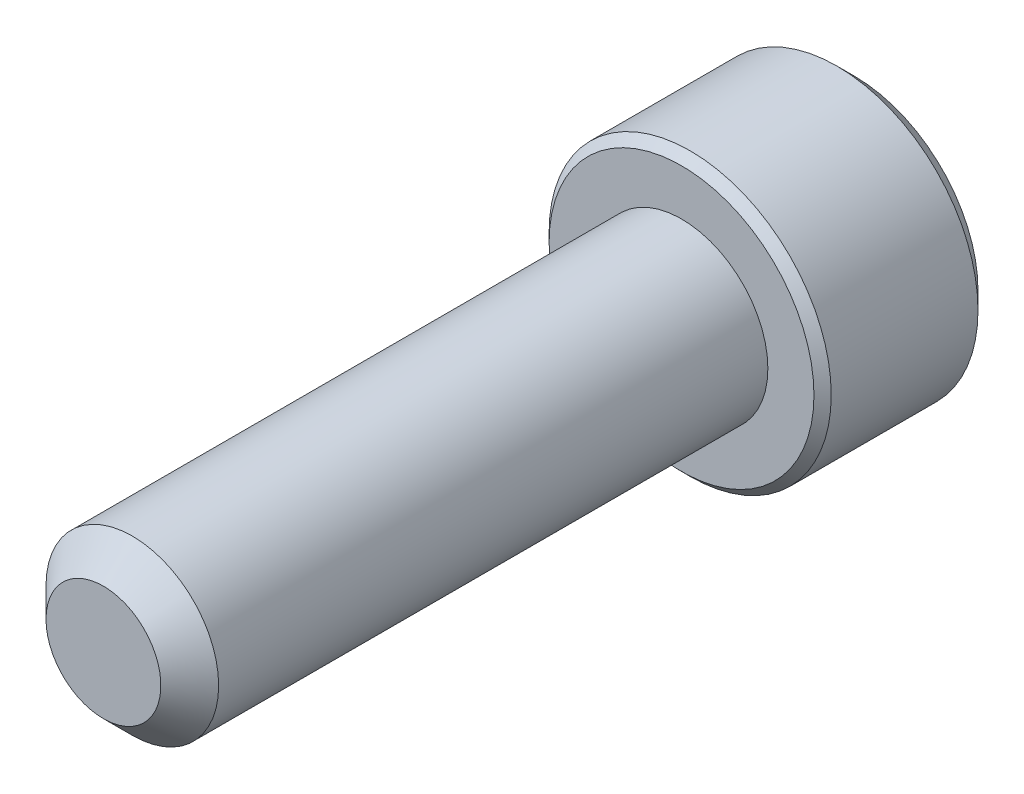
ISO-10303-21;
HEADER;
FILE_DESCRIPTION(('STEP AP214'),'2;1');
FILE_NAME('part.step','',(''),(''),'','','');
FILE_SCHEMA(('AUTOMOTIVE_DESIGN { 1 0 10303 214 1 1 1 1 }'));
ENDSEC;
DATA;
#1=APPLICATION_CONTEXT('core data for automotive mechanical design processes');
#2=APPLICATION_PROTOCOL_DEFINITION('international standard','automotive_design',2000,#1);
#3=PRODUCT_CONTEXT('',#1,'mechanical');
#4=PRODUCT('Part','Part','',(#3));
#5=PRODUCT_RELATED_PRODUCT_CATEGORY('part','',(#4));
#6=PRODUCT_DEFINITION_FORMATION('','',#4);
#7=PRODUCT_DEFINITION_CONTEXT('part definition',#1,'design');
#8=PRODUCT_DEFINITION('design','',#6,#7);
#9=PRODUCT_DEFINITION_SHAPE('','',#8);
#10=(LENGTH_UNIT() NAMED_UNIT(*) SI_UNIT(.MILLI.,.METRE.));
#11=(NAMED_UNIT(*) PLANE_ANGLE_UNIT() SI_UNIT($,.RADIAN.));
#12=(NAMED_UNIT(*) SI_UNIT($,.STERADIAN.) SOLID_ANGLE_UNIT());
#13=UNCERTAINTY_MEASURE_WITH_UNIT(LENGTH_MEASURE(1.E-05),#10,'distance_accuracy_value','');
#14=(GEOMETRIC_REPRESENTATION_CONTEXT(3) GLOBAL_UNCERTAINTY_ASSIGNED_CONTEXT((#13)) GLOBAL_UNIT_ASSIGNED_CONTEXT((#10,
#11,#12)) REPRESENTATION_CONTEXT('',''));
#15=CARTESIAN_POINT('',(0.,0.,0.));
#16=DIRECTION('',(0.,0.,1.));
#17=DIRECTION('',(1.,0.,0.));
#18=AXIS2_PLACEMENT_3D('',#15,#16,#17);
#19=CARTESIAN_POINT('',(0.,-1.3748153285078,-10.5838625));
#20=DIRECTION('',(-0.5,-0.866025403784439,0.));
#21=DIRECTION('',(0.866025403784439,-0.5,0.));
#22=AXIS2_PLACEMENT_3D('',#19,#20,#21);
#23=PLANE('',#22);
#24=CARTESIAN_POINT('',(-1.19062499999881,-0.687407664254587,-12.369799999977));
#25=CARTESIAN_POINT('',(-1.14970263914881,-0.71103420030721,-12.3461961353085));
#26=CARTESIAN_POINT('',(-1.10809605274547,-0.735055774167238,-12.3239787963404));
#27=CARTESIAN_POINT('',(-1.02325595332752,-0.784038228404265,-12.283299797289));
#28=CARTESIAN_POINT('',(-0.980014376423833,-0.809003764469793,-12.2648607635923));
#29=CARTESIAN_POINT('',(-0.892819863316976,-0.859345540083896,-12.233274570625));
#30=CARTESIAN_POINT('',(-0.848889120869722,-0.884708966061518,-12.2200480421541));
#31=CARTESIAN_POINT('',(-0.760060747044089,-0.935994051601424,-12.1996700714323));
#32=CARTESIAN_POINT('',(-0.715165827349434,-0.96191414557238,-12.1925034234483));
#33=CARTESIAN_POINT('',(-0.637785345129712,-1.00658978781196,-12.1860368684439));
#34=CARTESIAN_POINT('',(-0.605399644530298,-1.02528768077093,-12.1850799496617));
#35=CARTESIAN_POINT('',(-0.540685248328487,-1.06265055483848,-12.1866947291663));
#36=CARTESIAN_POINT('',(-0.508356566897669,-1.08131552776511,-12.1892672069147));
#37=CARTESIAN_POINT('',(-0.444011322798376,-1.11846527176691,-12.1977920715166));
#38=CARTESIAN_POINT('',(-0.411995078564867,-1.13694985899357,-12.2037476013051));
#39=CARTESIAN_POINT('',(-0.348497138371782,-1.17361041185703,-12.2187178210994));
#40=CARTESIAN_POINT('',(-0.317015677881833,-1.19178624154539,-12.2277338237807));
#41=CARTESIAN_POINT('',(-0.236423425363977,-1.23831620023117,-12.254479235798));
#42=CARTESIAN_POINT('',(-0.187819783521471,-1.26637752593254,-12.274216001141));
#43=CARTESIAN_POINT('',(-0.0925140443550534,-1.32140232009559,-12.3186731392608));
#44=CARTESIAN_POINT('',(-0.0458063370178413,-1.34836902749996,-12.3433772891907));
#45=CARTESIAN_POINT('',(-1.19285972376366E-12,-1.37481532850711,-12.369799999977));
#46=B_SPLINE_CURVE_WITH_KNOTS('',3,(#24,#25,#26,#27,#28,#29,#30,#31,#32,#33,#34,#35,#36,#37,#38,
#39,#40,#41,#42,#43,#44,#45),.UNSPECIFIED.,.F.,.F.,(4,2,2,2,2,2,2,2,2,2,4),(0.,
0.158570945772296,0.318065397807621,0.475027617237847,0.631594801032415,0.743660160720115,
0.855750273845473,0.967944692031846,1.08018729275019,1.25836291038388,1.43596581384777),.UNSPECIFIED.);
#47=CARTESIAN_POINT('',(-1.19062499995943,-0.687407664276631,-12.3697999999539));
#48=VERTEX_POINT('',#47);
#49=CARTESIAN_POINT('',(3.99696768345484E-11,-1.37481532848403,-12.3697999999539));
#50=VERTEX_POINT('',#49);
#51=EDGE_CURVE('E21',#48,#50,#46,.T.);
#52=ORIENTED_EDGE('',*,*,#51,.F.);
#53=DIRECTION('',(0.,0.,1.));
#54=VECTOR('',#53,1.);
#55=CARTESIAN_POINT('',(-1.190625,-0.687407664253898,-10.5838625));
#56=LINE('',#55,#54);
#57=CARTESIAN_POINT('',(-1.190625,-0.687407664253899,-10.5838625));
#58=VERTEX_POINT('',#57);
#59=EDGE_CURVE('E102',#48,#58,#56,.T.);
#60=ORIENTED_EDGE('',*,*,#59,.T.);
#61=DIRECTION('',(0.866025403784439,-0.5,0.));
#62=VECTOR('',#61,1.);
#63=CARTESIAN_POINT('',(0.,-1.3748153285078,-10.5838625));
#64=LINE('',#63,#62);
#65=CARTESIAN_POINT('',(0.,-1.3748153285078,-10.5838625));
#66=VERTEX_POINT('',#65);
#67=EDGE_CURVE('E75',#66,#58,#64,.F.);
#68=ORIENTED_EDGE('',*,*,#67,.F.);
#69=DIRECTION('',(0.,0.,1.));
#70=VECTOR('',#69,1.);
#71=CARTESIAN_POINT('',(0.,-1.3748153285078,-10.5838625));
#72=LINE('',#71,#70);
#73=EDGE_CURVE('E74',#66,#50,#72,.F.);
#74=ORIENTED_EDGE('',*,*,#73,.T.);
#75=EDGE_LOOP('',(#52,#60,#68,#74));
#76=FACE_BOUND('',#75,.T.);
#77=ADVANCED_FACE('F17',(#76),#23,.F.);
#78=CARTESIAN_POINT('',(1.190625,-0.687407664253898,-10.5838625));
#79=DIRECTION('',(0.5,-0.866025403784439,0.));
#80=DIRECTION('',(0.866025403784439,0.5,0.));
#81=AXIS2_PLACEMENT_3D('',#78,#79,#80);
#82=PLANE('',#81);
#83=CARTESIAN_POINT('',(1.1932416085199E-12,-1.37481532850711,-12.369799999977));
#84=CARTESIAN_POINT('',(0.0409223608511937,-1.35118879245448,-12.3461961353085));
#85=CARTESIAN_POINT('',(0.0825289472545307,-1.32716721859446,-12.3239787963404));
#86=CARTESIAN_POINT('',(0.167369046672479,-1.27818476435743,-12.283299797289));
#87=CARTESIAN_POINT('',(0.210610623576167,-1.2532192282919,-12.2648607635923));
#88=CARTESIAN_POINT('',(0.297805136683024,-1.2028774526778,-12.233274570625));
#89=CARTESIAN_POINT('',(0.341735879130278,-1.17751402670018,-12.2200480421541));
#90=CARTESIAN_POINT('',(0.430564252955911,-1.12622894116027,-12.1996700714323));
#91=CARTESIAN_POINT('',(0.475459172650566,-1.10030884718932,-12.1925034234483));
#92=CARTESIAN_POINT('',(0.552839654870287,-1.05563320494974,-12.1860368684439));
#93=CARTESIAN_POINT('',(0.585225355469702,-1.03693531199077,-12.1850799496617));
#94=CARTESIAN_POINT('',(0.649939751671512,-0.99957243792321,-12.1866947291663));
#95=CARTESIAN_POINT('',(0.682268433102331,-0.980907464996582,-12.1892672069147));
#96=CARTESIAN_POINT('',(0.746613677201623,-0.943757720994783,-12.1977920715166));
#97=CARTESIAN_POINT('',(0.778629921435132,-0.925273133768126,-12.2037476013051));
#98=CARTESIAN_POINT('',(0.842127861628218,-0.888612580904661,-12.2187178210994));
#99=CARTESIAN_POINT('',(0.873609322118167,-0.870436751216306,-12.2277338237807));
#100=CARTESIAN_POINT('',(0.954201574636023,-0.823906792530524,-12.254479235798));
#101=CARTESIAN_POINT('',(1.00280521647853,-0.795845466829157,-12.274216001141));
#102=CARTESIAN_POINT('',(1.09811095564495,-0.740820672666109,-12.3186731392608));
#103=CARTESIAN_POINT('',(1.14481866298216,-0.713853965261739,-12.3433772891907));
#104=CARTESIAN_POINT('',(1.19062499999881,-0.687407664254587,-12.369799999977));
#105=B_SPLINE_CURVE_WITH_KNOTS('',3,(#83,#84,#85,#86,#87,#88,#89,#90,#91,#92,#93,#94,#95,#96,
#97,#98,#99,#100,#101,#102,#103,#104),.UNSPECIFIED.,.F.,.F.,(4,2,2,2,2,2,2,2,2,2,4),(0.,
0.158570945772295,0.31806539780762,0.475027617237846,0.631594801032413,0.743660160720113,
0.855750273845471,0.967944692031845,1.08018729275019,1.25836291038388,1.43596581384777),.UNSPECIFIED.);
#106=CARTESIAN_POINT('',(1.1906249999994,-0.687407664207401,-12.3697999999539));
#107=VERTEX_POINT('',#106);
#108=EDGE_CURVE('E82',#50,#107,#105,.T.);
#109=ORIENTED_EDGE('',*,*,#108,.F.);
#110=ORIENTED_EDGE('',*,*,#73,.F.);
#111=DIRECTION('',(-0.866025403784439,-0.5,0.));
#112=VECTOR('',#111,1.);
#113=CARTESIAN_POINT('',(1.190625,-0.687407664253899,-10.5838625));
#114=LINE('',#113,#112);
#115=CARTESIAN_POINT('',(1.190625,-0.687407664253899,-10.5838625));
#116=VERTEX_POINT('',#115);
#117=EDGE_CURVE('E262',#116,#66,#114,.T.);
#118=ORIENTED_EDGE('',*,*,#117,.F.);
#119=DIRECTION('',(0.,0.,1.));
#120=VECTOR('',#119,1.);
#121=CARTESIAN_POINT('',(1.190625,-0.687407664253898,-10.5838625));
#122=LINE('',#121,#120);
#123=EDGE_CURVE('E101',#116,#107,#122,.F.);
#124=ORIENTED_EDGE('',*,*,#123,.T.);
#125=EDGE_LOOP('',(#109,#110,#118,#124));
#126=FACE_BOUND('',#125,.T.);
#127=ADVANCED_FACE('F99',(#126),#82,.F.);
#128=CARTESIAN_POINT('',(-1.190625,-0.687407664253898,-10.5838625));
#129=DIRECTION('',(-1.,0.,0.));
#130=DIRECTION('',(0.,-1.,0.));
#131=AXIS2_PLACEMENT_3D('',#128,#129,#130);
#132=PLANE('',#131);
#133=CARTESIAN_POINT('',(-1.190625,0.687407664252521,-12.369799999977));
#134=CARTESIAN_POINT('',(-1.19062500000005,0.640463282064595,-12.3463497101783));
#135=CARTESIAN_POINT('',(-1.19062500000003,0.592738991402292,-12.32426868611));
#136=CARTESIAN_POINT('',(-1.19062499999997,0.495406225284844,-12.2837937229987));
#137=CARTESIAN_POINT('',(-1.19062499999994,0.44578762960619,-12.2654243363586));
#138=CARTESIAN_POINT('',(-1.19062500000006,0.34511637586352,-12.2337043536795));
#139=CARTESIAN_POINT('',(-1.19062500000019,0.294069215620467,-12.2203367724588));
#140=CARTESIAN_POINT('',(-1.19062499999981,0.190855854867608,-12.1997568032896));
#141=CARTESIAN_POINT('',(-1.19062499999928,0.138693633194763,-12.1925253813224));
#142=CARTESIAN_POINT('',(-1.1906250000002,0.0719511130961473,-12.187694661515));
#143=CARTESIAN_POINT('',(-1.19062500000049,0.0575681067344911,-12.1869136852728));
#144=CARTESIAN_POINT('',(-1.19062499999951,0.028790738740622,-12.1858710957012));
#145=CARTESIAN_POINT('',(-1.19062499999826,0.0143963875333184,-12.1856092002387));
#146=CARTESIAN_POINT('',(-1.1906249999962,-0.0361321030316937,-12.1856108539726));
#147=CARTESIAN_POINT('',(-1.19062499999896,-0.0722770331117413,-12.1872647137198));
#148=CARTESIAN_POINT('',(-1.19062500000104,-0.144284982530425,-12.1937819306667));
#149=CARTESIAN_POINT('',(-1.19062500000036,-0.180147787576177,-12.1986475264138));
#150=CARTESIAN_POINT('',(-1.19062499999927,-0.28725825155665,-12.2177577375905));
#151=CARTESIAN_POINT('',(-1.19062499999983,-0.357725297205686,-12.236512535572));
#152=CARTESIAN_POINT('',(-1.19062500000011,-0.471552892308815,-12.2748800214593));
#153=CARTESIAN_POINT('',(-1.19062500000006,-0.515840765794466,-12.2919407465333));
#154=CARTESIAN_POINT('',(-1.19062499999995,-0.602739573047212,-12.3289168423641));
#155=CARTESIAN_POINT('',(-1.19062499999989,-0.645362139901087,-12.3488046757826));
#156=CARTESIAN_POINT('',(-1.190625,-0.687407664252521,-12.369799999977));
#157=B_SPLINE_CURVE_WITH_KNOTS('',3,(#133,#134,#135,#136,#137,#138,#139,#140,#141,#142,#143,
#144,#145,#146,#147,#148,#149,#150,#151,#152,#153,#154,#155,#156),.UNSPECIFIED.,.F.,.F.,(4,2,2,
2,2,2,2,2,2,2,2,4),(0.,0.157535403069656,0.316081041392854,0.47408329447992,0.631593622954263,
0.674799714990171,0.717982317005663,0.826362160323254,0.934817623172791,1.15262451036348,
1.29491478047678,1.43590359049431),.UNSPECIFIED.);
#158=CARTESIAN_POINT('',(-1.1906249999994,0.687407664207401,-12.3697999999539));
#159=VERTEX_POINT('',#158);
#160=EDGE_CURVE('E59',#159,#48,#157,.T.);
#161=ORIENTED_EDGE('',*,*,#160,.F.);
#162=DIRECTION('',(0.,0.,1.));
#163=VECTOR('',#162,1.);
#164=CARTESIAN_POINT('',(-1.190625,0.687407664253898,-10.5838625));
#165=LINE('',#164,#163);
#166=CARTESIAN_POINT('',(-1.190625,0.687407664253899,-10.5838625));
#167=VERTEX_POINT('',#166);
#168=EDGE_CURVE('E239',#159,#167,#165,.T.);
#169=ORIENTED_EDGE('',*,*,#168,.T.);
#170=DIRECTION('',(0.,1.,0.));
#171=VECTOR('',#170,1.);
#172=CARTESIAN_POINT('',(-1.190625,2.06222299276169,-10.5838625));
#173=LINE('',#172,#171);
#174=EDGE_CURVE('E258',#58,#167,#173,.T.);
#175=ORIENTED_EDGE('',*,*,#174,.F.);
#176=ORIENTED_EDGE('',*,*,#59,.F.);
#177=EDGE_LOOP('',(#161,#169,#175,#176));
#178=FACE_BOUND('',#177,.T.);
#179=ADVANCED_FACE('F118',(#178),#132,.F.);
#180=CARTESIAN_POINT('',(1.190625,2.06222299276169,-10.5838625));
#181=DIRECTION('',(0.,0.,-1.));
#182=DIRECTION('',(-1.,0.,0.));
#183=AXIS2_PLACEMENT_3D('',#180,#181,#182);
#184=PLANE('',#183);
#185=ORIENTED_EDGE('',*,*,#67,.T.);
#186=ORIENTED_EDGE('',*,*,#174,.T.);
#187=DIRECTION('',(-0.866025403784439,-0.5,0.));
#188=VECTOR('',#187,1.);
#189=CARTESIAN_POINT('',(-1.190625,0.687407664253898,-10.5838625));
#190=LINE('',#189,#188);
#191=CARTESIAN_POINT('',(0.,1.3748153285078,-10.5838625));
#192=VERTEX_POINT('',#191);
#193=EDGE_CURVE('E139',#167,#192,#190,.F.);
#194=ORIENTED_EDGE('',*,*,#193,.T.);
#195=DIRECTION('',(-0.866025403784439,0.5,0.));
#196=VECTOR('',#195,1.);
#197=CARTESIAN_POINT('',(0.,1.3748153285078,-10.5838625));
#198=LINE('',#197,#196);
#199=CARTESIAN_POINT('',(1.190625,0.687407664253898,-10.5838625));
#200=VERTEX_POINT('',#199);
#201=EDGE_CURVE('E236',#192,#200,#198,.F.);
#202=ORIENTED_EDGE('',*,*,#201,.T.);
#203=DIRECTION('',(0.,1.,0.));
#204=VECTOR('',#203,1.);
#205=CARTESIAN_POINT('',(1.190625,0.687407664253898,-10.5838625));
#206=LINE('',#205,#204);
#207=EDGE_CURVE('E253',#200,#116,#206,.F.);
#208=ORIENTED_EDGE('',*,*,#207,.T.);
#209=ORIENTED_EDGE('',*,*,#117,.T.);
#210=EDGE_LOOP('',(#185,#186,#194,#202,#208,#209));
#211=FACE_BOUND('',#210,.T.);
#212=ADVANCED_FACE('F122',(#211),#184,.T.);
#213=CARTESIAN_POINT('',(1.190625,0.687407664253898,-10.5838625));
#214=DIRECTION('',(1.,0.,0.));
#215=DIRECTION('',(0.,1.,0.));
#216=AXIS2_PLACEMENT_3D('',#213,#214,#215);
#217=PLANE('',#216);
#218=CARTESIAN_POINT('',(1.190625,-0.68740766425252,-12.369799999977));
#219=CARTESIAN_POINT('',(1.190625,-0.640154592147277,-12.3461961353085));
#220=CARTESIAN_POINT('',(1.190625,-0.592111444427223,-12.3239787963404));
#221=CARTESIAN_POINT('',(1.190625,-0.494146535953174,-12.283299797289));
#222=CARTESIAN_POINT('',(1.190625,-0.44421546382212,-12.2648607635923));
#223=CARTESIAN_POINT('',(1.190625,-0.343531912593916,-12.233274570625));
#224=CARTESIAN_POINT('',(1.190625,-0.292805060638669,-12.2200480421541));
#225=CARTESIAN_POINT('',(1.190625,-0.190234889558853,-12.1996700714323));
#226=CARTESIAN_POINT('',(1.190625,-0.138394701616939,-12.1925034234483));
#227=CARTESIAN_POINT('',(1.190625,-0.0490434171377777,-12.1860368684439));
#228=CARTESIAN_POINT('',(1.190625,-0.0116476312198433,-12.1850799496617));
#229=CARTESIAN_POINT('',(1.190625,0.0630781169152773,-12.1866947291663));
#230=CARTESIAN_POINT('',(1.190625,0.100408062768536,-12.1892672069147));
#231=CARTESIAN_POINT('',(1.190625,0.174707550772133,-12.1977920715166));
#232=CARTESIAN_POINT('',(1.190625,0.211676725225447,-12.2037476013051));
#233=CARTESIAN_POINT('',(1.190625,0.284997830952374,-12.2187178210994));
#234=CARTESIAN_POINT('',(1.190625,0.321349490329082,-12.2277338237807));
#235=CARTESIAN_POINT('',(1.190625,0.414409407700174,-12.2544792357979));
#236=CARTESIAN_POINT('',(1.190625,0.470532059102451,-12.2742160011407));
#237=CARTESIAN_POINT('',(1.190625,0.58058164742767,-12.3186731392601));
#238=CARTESIAN_POINT('',(1.190625,0.634515062235989,-12.3433772891896));
#239=CARTESIAN_POINT('',(1.190625,0.687407664249891,-12.3697999999757));
#240=B_SPLINE_CURVE_WITH_KNOTS('',3,(#218,#219,#220,#221,#222,#223,#224,#225,#226,#227,#228,
#229,#230,#231,#232,#233,#234,#235,#236,#237,#238,#239),.UNSPECIFIED.,.F.,.F.,(4,2,2,2,2,2,2,2,
2,2,4),(0.,0.158570945772289,0.318065397807605,0.475027617237838,0.631594801032413,
0.743660160720116,0.855750273845476,0.967944692031847,1.08018729275019,1.2583629103824,
1.43596581384484),.UNSPECIFIED.);
#241=CARTESIAN_POINT('',(1.19062499997972,0.687407664242188,-12.3697999999542));
#242=VERTEX_POINT('',#241);
#243=EDGE_CURVE('E39',#107,#242,#240,.T.);
#244=ORIENTED_EDGE('',*,*,#243,.F.);
#245=ORIENTED_EDGE('',*,*,#123,.F.);
#246=ORIENTED_EDGE('',*,*,#207,.F.);
#247=DIRECTION('',(0.,0.,1.));
#248=VECTOR('',#247,1.);
#249=CARTESIAN_POINT('',(1.190625,0.687407664253898,-10.5838625));
#250=LINE('',#249,#248);
#251=EDGE_CURVE('E232',#200,#242,#250,.F.);
#252=ORIENTED_EDGE('',*,*,#251,.T.);
#253=EDGE_LOOP('',(#244,#245,#246,#252));
#254=FACE_BOUND('',#253,.T.);
#255=ADVANCED_FACE('F126',(#254),#217,.F.);
#256=CARTESIAN_POINT('',(-1.190625,0.687407664253898,-10.5838625));
#257=DIRECTION('',(-0.5,0.866025403784439,0.));
#258=DIRECTION('',(-0.866025403784439,-0.5,0.));
#259=AXIS2_PLACEMENT_3D('',#256,#257,#258);
#260=PLANE('',#259);
#261=CARTESIAN_POINT('',(-3.47060595855084E-12,1.37481532850579,-12.3697999999757));
#262=CARTESIAN_POINT('',(-0.0409223608533353,1.35118879245325,-12.3461961353073));
#263=CARTESIAN_POINT('',(-0.0825289472565333,1.3271672185933,-12.3239787963393));
#264=CARTESIAN_POINT('',(-0.16736904667419,1.27818476435644,-12.2832997972882));
#265=CARTESIAN_POINT('',(-0.210610623577726,1.253219228291,-12.2648607635916));
#266=CARTESIAN_POINT('',(-0.29780513668427,1.20287745267708,-12.2332745706246));
#267=CARTESIAN_POINT('',(-0.341735879131363,1.17751402669955,-12.2200480421538));
#268=CARTESIAN_POINT('',(-0.430564252956665,1.12622894115984,-12.1996700714322));
#269=CARTESIAN_POINT('',(-0.475459172651149,1.10030884718898,-12.1925034234483));
#270=CARTESIAN_POINT('',(-0.55283965487069,1.0556332049495,-12.1860368684439));
#271=CARTESIAN_POINT('',(-0.585225355470097,1.03693531199054,-12.1850799496617));
#272=CARTESIAN_POINT('',(-0.649939751671892,0.999572437922991,-12.1866947291663));
#273=CARTESIAN_POINT('',(-0.682268433102702,0.980907464996367,-12.1892672069147));
#274=CARTESIAN_POINT('',(-0.746613677201977,0.943757720994578,-12.1977920715167));
#275=CARTESIAN_POINT('',(-0.778629921435478,0.925273133767926,-12.2037476013051));
#276=CARTESIAN_POINT('',(-0.842127861628547,0.888612580904471,-12.2187178210995));
#277=CARTESIAN_POINT('',(-0.873609322118487,0.870436751216122,-12.2277338237808));
#278=CARTESIAN_POINT('',(-0.95420157463628,0.823906792530376,-12.2544792357981));
#279=CARTESIAN_POINT('',(-1.00280521647873,0.795845466829039,-12.2742160011411));
#280=CARTESIAN_POINT('',(-1.09811095564505,0.740820672666052,-12.3186731392609));
#281=CARTESIAN_POINT('',(-1.14481866298221,0.713853965261712,-12.3433772891907));
#282=CARTESIAN_POINT('',(-1.19062499999881,0.687407664254587,-12.369799999977));
#283=B_SPLINE_CURVE_WITH_KNOTS('',3,(#261,#262,#263,#264,#265,#266,#267,#268,#269,#270,#271,
#272,#273,#274,#275,#276,#277,#278,#279,#280,#281,#282),.UNSPECIFIED.,.F.,.F.,(4,2,2,2,2,2,2,2,
2,2,4),(0.,0.15857094577168,0.318065397806374,0.475027617235989,0.63159480102995,
0.743660160717623,0.855750273842954,0.967944692029305,1.08018729274762,1.25836291038113,
1.43596581384484),.UNSPECIFIED.);
#284=CARTESIAN_POINT('',(3.88310346939571E-11,1.37481532848337,-12.3697999999532));
#285=VERTEX_POINT('',#284);
#286=EDGE_CURVE('E140',#285,#159,#283,.T.);
#287=ORIENTED_EDGE('',*,*,#286,.F.);
#288=DIRECTION('',(0.,0.,1.));
#289=VECTOR('',#288,1.);
#290=CARTESIAN_POINT('',(0.,1.3748153285078,-10.5838625));
#291=LINE('',#290,#289);
#292=EDGE_CURVE('E163',#285,#192,#291,.T.);
#293=ORIENTED_EDGE('',*,*,#292,.T.);
#294=ORIENTED_EDGE('',*,*,#193,.F.);
#295=ORIENTED_EDGE('',*,*,#168,.F.);
#296=EDGE_LOOP('',(#287,#293,#294,#295));
#297=FACE_BOUND('',#296,.T.);
#298=ADVANCED_FACE('F131',(#297),#260,.F.);
#299=CARTESIAN_POINT('',(0.,1.3748153285078,-10.5838625));
#300=DIRECTION('',(0.5,0.866025403784439,0.));
#301=DIRECTION('',(-0.866025403784439,0.5,0.));
#302=AXIS2_PLACEMENT_3D('',#299,#300,#301);
#303=PLANE('',#302);
#304=CARTESIAN_POINT('',(3.47085790374751E-12,1.37481532850579,-12.3697999999757));
#305=CARTESIAN_POINT('',(0.0409223608533338,1.35118879245325,-12.3461961353073));
#306=CARTESIAN_POINT('',(0.0825289472565301,1.3271672185933,-12.3239787963393));
#307=CARTESIAN_POINT('',(0.167369046674183,1.27818476435645,-12.2832997972882));
#308=CARTESIAN_POINT('',(0.210610623577716,1.25321922829101,-12.2648607635916));
#309=CARTESIAN_POINT('',(0.29780513668426,1.20287745267709,-12.2332745706246));
#310=CARTESIAN_POINT('',(0.341735879131355,1.17751402669955,-12.2200480421538));
#311=CARTESIAN_POINT('',(0.430564252956661,1.12622894115984,-12.1996700714322));
#312=CARTESIAN_POINT('',(0.475459172651147,1.10030884718898,-12.1925034234483));
#313=CARTESIAN_POINT('',(0.552839654870691,1.0556332049495,-12.1860368684439));
#314=CARTESIAN_POINT('',(0.585225355470099,1.03693531199054,-12.1850799496617));
#315=CARTESIAN_POINT('',(0.649939751671895,0.999572437922989,-12.1866947291663));
#316=CARTESIAN_POINT('',(0.682268433102706,0.980907464996365,-12.1892672069147));
#317=CARTESIAN_POINT('',(0.746613677201981,0.943757720994576,-12.1977920715167));
#318=CARTESIAN_POINT('',(0.778629921435481,0.925273133767924,-12.2037476013051));
#319=CARTESIAN_POINT('',(0.842127861628548,0.88861258090447,-12.2187178210995));
#320=CARTESIAN_POINT('',(0.873609322118488,0.870436751216121,-12.2277338237808));
#321=CARTESIAN_POINT('',(0.95420157463587,0.823906792530612,-12.254479235798));
#322=CARTESIAN_POINT('',(1.00280521647793,0.795845466829504,-12.2742160011408));
#323=CARTESIAN_POINT('',(1.09811095564348,0.740820672666955,-12.3186731392601));
#324=CARTESIAN_POINT('',(1.14481866298028,0.713853965262825,-12.3433772891897));
#325=CARTESIAN_POINT('',(1.19062499999653,0.687407664255902,-12.3697999999757));
#326=B_SPLINE_CURVE_WITH_KNOTS('',3,(#304,#305,#306,#307,#308,#309,#310,#311,#312,#313,#314,
#315,#316,#317,#318,#319,#320,#321,#322,#323,#324,#325),.UNSPECIFIED.,.F.,.F.,(4,2,2,2,2,2,2,2,
2,2,4),(0.,0.158570945771674,0.31806539780636,0.475027617235981,0.63159480102995,
0.743660160717626,0.85575027384296,0.967944692029307,1.08018729274762,1.25836291037966,
1.4359658138419),.UNSPECIFIED.);
#327=EDGE_CURVE('E156',#285,#242,#326,.T.);
#328=ORIENTED_EDGE('',*,*,#327,.T.);
#329=ORIENTED_EDGE('',*,*,#251,.F.);
#330=ORIENTED_EDGE('',*,*,#201,.F.);
#331=ORIENTED_EDGE('',*,*,#292,.F.);
#332=EDGE_LOOP('',(#328,#329,#330,#331));
#333=FACE_BOUND('',#332,.T.);
#334=ADVANCED_FACE('F165',(#333),#303,.F.);
#335=CARTESIAN_POINT('',(0.,0.,-12.369799999874));
#336=DIRECTION('',(0.,0.,-1.));
#337=DIRECTION('',(-1.,0.,0.));
#338=AXIS2_PLACEMENT_3D('',#335,#336,#337);
#339=CONICAL_SURFACE('',#338,1.37481532840411,0.785398163397448);
#340=ORIENTED_EDGE('',*,*,#286,.T.);
#341=CARTESIAN_POINT('',(0.,0.,-12.3697999999308));
#342=DIRECTION('',(0.,0.,-1.));
#343=DIRECTION('',(-1.,0.,0.));
#344=AXIS2_PLACEMENT_3D('',#341,#342,#343);
#345=CIRCLE('',#344,1.37481532846095);
#346=EDGE_CURVE('E162',#285,#159,#345,.F.);
#347=ORIENTED_EDGE('',*,*,#346,.F.);
#348=EDGE_LOOP('',(#340,#347));
#349=FACE_BOUND('',#348,.T.);
#350=ADVANCED_FACE('F168',(#349),#339,.F.);
#351=CARTESIAN_POINT('',(0.,0.,-12.369799999874));
#352=DIRECTION('',(0.,0.,-1.));
#353=DIRECTION('',(-1.,0.,0.));
#354=AXIS2_PLACEMENT_3D('',#351,#352,#353);
#355=CONICAL_SURFACE('',#354,1.37481532840411,0.785398163244062);
#356=ORIENTED_EDGE('',*,*,#160,.T.);
#357=CARTESIAN_POINT('',(0.,0.,-12.3697999999308));
#358=DIRECTION('',(0.,0.,-1.));
#359=DIRECTION('',(-1.,0.,0.));
#360=AXIS2_PLACEMENT_3D('',#357,#358,#359);
#361=CIRCLE('',#360,1.37481532846095);
#362=EDGE_CURVE('E92',#159,#48,#361,.F.);
#363=ORIENTED_EDGE('',*,*,#362,.F.);
#364=EDGE_LOOP('',(#356,#363));
#365=FACE_BOUND('',#364,.T.);
#366=ADVANCED_FACE('F172',(#365),#355,.F.);
#367=CARTESIAN_POINT('',(0.,0.,-12.369799999874));
#368=DIRECTION('',(0.,0.,-1.));
#369=DIRECTION('',(-1.,0.,0.));
#370=AXIS2_PLACEMENT_3D('',#367,#368,#369);
#371=CONICAL_SURFACE('',#370,1.37481532840411,0.785398163397448);
#372=ORIENTED_EDGE('',*,*,#51,.T.);
#373=CARTESIAN_POINT('',(0.,0.,-12.3697999999308));
#374=DIRECTION('',(0.,0.,-1.));
#375=DIRECTION('',(-1.,0.,0.));
#376=AXIS2_PLACEMENT_3D('',#373,#374,#375);
#377=CIRCLE('',#376,1.37481532846095);
#378=EDGE_CURVE('E70',#48,#50,#377,.F.);
#379=ORIENTED_EDGE('',*,*,#378,.F.);
#380=EDGE_LOOP('',(#372,#379));
#381=FACE_BOUND('',#380,.T.);
#382=ADVANCED_FACE('F68',(#381),#371,.F.);
#383=CARTESIAN_POINT('',(0.,0.,-12.369799999874));
#384=DIRECTION('',(0.,0.,-1.));
#385=DIRECTION('',(-1.,0.,0.));
#386=AXIS2_PLACEMENT_3D('',#383,#384,#385);
#387=CONICAL_SURFACE('',#386,1.37481532840411,0.785398163397448);
#388=ORIENTED_EDGE('',*,*,#108,.T.);
#389=CARTESIAN_POINT('',(0.,0.,-12.3697999999308));
#390=DIRECTION('',(0.,0.,-1.));
#391=DIRECTION('',(-1.,0.,0.));
#392=AXIS2_PLACEMENT_3D('',#389,#390,#391);
#393=CIRCLE('',#392,1.37481532846095);
#394=EDGE_CURVE('E90',#50,#107,#393,.F.);
#395=ORIENTED_EDGE('',*,*,#394,.F.);
#396=EDGE_LOOP('',(#388,#395));
#397=FACE_BOUND('',#396,.T.);
#398=ADVANCED_FACE('F95',(#397),#387,.F.);
#399=CARTESIAN_POINT('',(0.,0.,-12.369799999874));
#400=DIRECTION('',(0.,0.,-1.));
#401=DIRECTION('',(-1.,0.,0.));
#402=AXIS2_PLACEMENT_3D('',#399,#400,#401);
#403=CONICAL_SURFACE('',#402,1.37481532840411,0.785398163397448);
#404=ORIENTED_EDGE('',*,*,#243,.T.);
#405=CARTESIAN_POINT('',(0.,0.,-12.3697999999308));
#406=DIRECTION('',(0.,0.,-1.));
#407=DIRECTION('',(-1.,0.,0.));
#408=AXIS2_PLACEMENT_3D('',#405,#406,#407);
#409=CIRCLE('',#408,1.37481532846095);
#410=EDGE_CURVE('E97',#107,#242,#409,.F.);
#411=ORIENTED_EDGE('',*,*,#410,.F.);
#412=EDGE_LOOP('',(#404,#411));
#413=FACE_BOUND('',#412,.T.);
#414=ADVANCED_FACE('F146',(#413),#403,.F.);
#415=CARTESIAN_POINT('',(0.,0.,-12.369799999874));
#416=DIRECTION('',(0.,0.,-1.));
#417=DIRECTION('',(-1.,0.,0.));
#418=AXIS2_PLACEMENT_3D('',#415,#416,#417);
#419=CONICAL_SURFACE('',#418,1.37481532840411,0.785398163397448);
#420=ORIENTED_EDGE('',*,*,#327,.F.);
#421=CARTESIAN_POINT('',(0.,0.,-12.3697999999308));
#422=DIRECTION('',(0.,0.,-1.));
#423=DIRECTION('',(-1.,0.,0.));
#424=AXIS2_PLACEMENT_3D('',#421,#422,#423);
#425=CIRCLE('',#424,1.37481532846095);
#426=EDGE_CURVE('E227',#242,#285,#425,.F.);
#427=ORIENTED_EDGE('',*,*,#426,.F.);
#428=EDGE_LOOP('',(#420,#427));
#429=FACE_BOUND('',#428,.T.);
#430=ADVANCED_FACE('F150',(#429),#419,.F.);
#431=CARTESIAN_POINT('',(0.,0.,-12.3698));
#432=DIRECTION('',(0.,0.,-1.));
#433=DIRECTION('',(-1.,0.,0.));
#434=AXIS2_PLACEMENT_3D('',#431,#432,#433);
#435=PLANE('',#434);
#436=ORIENTED_EDGE('',*,*,#410,.T.);
#437=ORIENTED_EDGE('',*,*,#426,.T.);
#438=ORIENTED_EDGE('',*,*,#346,.T.);
#439=ORIENTED_EDGE('',*,*,#362,.T.);
#440=ORIENTED_EDGE('',*,*,#378,.T.);
#441=ORIENTED_EDGE('',*,*,#394,.T.);
#442=EDGE_LOOP('',(#436,#437,#438,#439,#440,#441));
#443=FACE_BOUND('',#442,.T.);
#444=CARTESIAN_POINT('',(0.,0.,-12.3697999999877));
#445=DIRECTION('',(0.,0.,1.));
#446=DIRECTION('',(0.,-1.,0.));
#447=AXIS2_PLACEMENT_3D('',#444,#445,#446);
#448=CIRCLE('',#447,2.03962000000502);
#449=CARTESIAN_POINT('',(0.,-2.03962000000502,-12.3697999999877));
#450=VERTEX_POINT('',#449);
#451=EDGE_CURVE('E218',#450,#450,#448,.T.);
#452=ORIENTED_EDGE('',*,*,#451,.F.);
#453=EDGE_LOOP('',(#452));
#454=FACE_BOUND('',#453,.T.);
#455=ADVANCED_FACE('F88',(#443,#454),#435,.T.);
#456=CARTESIAN_POINT('',(0.,0.,-12.0853199999829));
#457=DIRECTION('',(0.,0.,1.));
#458=DIRECTION('',(0.,-1.,0.));
#459=AXIS2_PLACEMENT_3D('',#456,#457,#458);
#460=CONICAL_SURFACE('',#459,2.32410000006666,0.785398163497356);
#461=ORIENTED_EDGE('',*,*,#451,.T.);
#462=EDGE_LOOP('',(#461));
#463=FACE_BOUND('',#462,.T.);
#464=CARTESIAN_POINT('',(0.,0.,-12.08532));
#465=DIRECTION('',(0.,0.,1.));
#466=DIRECTION('',(1.,0.,0.));
#467=AXIS2_PLACEMENT_3D('',#464,#465,#466);
#468=CIRCLE('',#467,2.3241);
#469=CARTESIAN_POINT('',(2.3241,0.,-12.08532));
#470=VERTEX_POINT('',#469);
#471=EDGE_CURVE('E221',#470,#470,#468,.T.);
#472=ORIENTED_EDGE('',*,*,#471,.F.);
#473=EDGE_LOOP('',(#472));
#474=FACE_BOUND('',#473,.T.);
#475=ADVANCED_FACE('F208',(#463,#474),#460,.T.);
#476=CARTESIAN_POINT('',(0.,0.,-12.3698));
#477=DIRECTION('',(0.,0.,1.));
#478=DIRECTION('',(1.,0.,0.));
#479=AXIS2_PLACEMENT_3D('',#476,#477,#478);
#480=CYLINDRICAL_SURFACE('',#479,2.3241);
#481=ORIENTED_EDGE('',*,*,#471,.T.);
#482=EDGE_LOOP('',(#481));
#483=FACE_BOUND('',#482,.T.);
#484=CARTESIAN_POINT('',(0.,0.,-9.66723999999886));
#485=DIRECTION('',(0.,0.,-1.));
#486=DIRECTION('',(-1.,0.,0.));
#487=AXIS2_PLACEMENT_3D('',#484,#485,#486);
#488=CIRCLE('',#487,2.32409999995298);
#489=CARTESIAN_POINT('',(-2.32409999995298,0.,-9.66723999999886));
#490=VERTEX_POINT('',#489);
#491=EDGE_CURVE('E222',#490,#490,#488,.F.);
#492=ORIENTED_EDGE('',*,*,#491,.F.);
#493=EDGE_LOOP('',(#492));
#494=FACE_BOUND('',#493,.T.);
#495=ADVANCED_FACE('F205',(#483,#494),#480,.T.);
#496=CARTESIAN_POINT('',(0.,0.,-9.66723999999886));
#497=DIRECTION('',(0.,0.,-1.));
#498=DIRECTION('',(-1.,0.,0.));
#499=AXIS2_PLACEMENT_3D('',#496,#497,#498);
#500=CONICAL_SURFACE('',#499,2.32409999995298,0.785398163197633);
#501=CARTESIAN_POINT('',(0.,0.,-9.5250000000533));
#502=DIRECTION('',(0.,0.,-1.));
#503=DIRECTION('',(-1.,0.,0.));
#504=AXIS2_PLACEMENT_3D('',#501,#502,#503);
#505=CIRCLE('',#504,2.18186000006426);
#506=CARTESIAN_POINT('',(-2.18186000006426,0.,-9.5250000000533));
#507=VERTEX_POINT('',#506);
#508=EDGE_CURVE('E225',#507,#507,#505,.T.);
#509=ORIENTED_EDGE('',*,*,#508,.T.);
#510=EDGE_LOOP('',(#509));
#511=FACE_BOUND('',#510,.T.);
#512=ORIENTED_EDGE('',*,*,#491,.T.);
#513=EDGE_LOOP('',(#512));
#514=FACE_BOUND('',#513,.T.);
#515=ADVANCED_FACE('F201',(#511,#514),#500,.T.);
#516=CARTESIAN_POINT('',(0.,0.,0.));
#517=DIRECTION('',(0.,0.,1.));
#518=DIRECTION('',(1.,0.,0.));
#519=AXIS2_PLACEMENT_3D('',#516,#517,#518);
#520=PLANE('',#519);
#521=CARTESIAN_POINT('',(0.,0.,0.));
#522=DIRECTION('',(0.,0.,-1.));
#523=DIRECTION('',(-1.,0.,0.));
#524=AXIS2_PLACEMENT_3D('',#521,#522,#523);
#525=CIRCLE('',#524,0.946149999947465);
#526=CARTESIAN_POINT('',(-0.946149999947465,0.,0.));
#527=VERTEX_POINT('',#526);
#528=EDGE_CURVE('E279',#527,#527,#525,.T.);
#529=ORIENTED_EDGE('',*,*,#528,.F.);
#530=EDGE_LOOP('',(#529));
#531=FACE_BOUND('',#530,.T.);
#532=ADVANCED_FACE('F197',(#531),#520,.T.);
#533=CARTESIAN_POINT('',(0.,0.,-9.525));
#534=DIRECTION('',(0.,0.,-1.));
#535=DIRECTION('',(-1.,0.,0.));
#536=AXIS2_PLACEMENT_3D('',#533,#534,#535);
#537=PLANE('',#536);
#538=CARTESIAN_POINT('',(0.,0.,-9.525));
#539=DIRECTION('',(0.,0.,1.));
#540=DIRECTION('',(1.,0.,0.));
#541=AXIS2_PLACEMENT_3D('',#538,#539,#540);
#542=CIRCLE('',#541,1.4224);
#543=CARTESIAN_POINT('',(1.4224,0.,-9.525));
#544=VERTEX_POINT('',#543);
#545=EDGE_CURVE('E31',#544,#544,#542,.T.);
#546=ORIENTED_EDGE('',*,*,#545,.F.);
#547=EDGE_LOOP('',(#546));
#548=FACE_BOUND('',#547,.T.);
#549=ORIENTED_EDGE('',*,*,#508,.F.);
#550=EDGE_LOOP('',(#549));
#551=FACE_BOUND('',#550,.T.);
#552=ADVANCED_FACE('F190',(#548,#551),#537,.F.);
#553=CARTESIAN_POINT('',(0.,0.,-0.476250000019718));
#554=DIRECTION('',(0.,0.,-1.));
#555=DIRECTION('',(-1.,0.,0.));
#556=AXIS2_PLACEMENT_3D('',#553,#554,#555);
#557=CONICAL_SURFACE('',#556,1.42240000002403,0.785398163457126);
#558=CARTESIAN_POINT('',(0.,0.,-0.476249999999998));
#559=DIRECTION('',(0.,0.,1.));
#560=DIRECTION('',(1.,0.,0.));
#561=AXIS2_PLACEMENT_3D('',#558,#559,#560);
#562=CIRCLE('',#561,1.4224);
#563=CARTESIAN_POINT('',(1.4224,0.,-0.476249999999998));
#564=VERTEX_POINT('',#563);
#565=EDGE_CURVE('E11',#564,#564,#562,.F.);
#566=ORIENTED_EDGE('',*,*,#565,.F.);
#567=EDGE_LOOP('',(#566));
#568=FACE_BOUND('',#567,.T.);
#569=ORIENTED_EDGE('',*,*,#528,.T.);
#570=EDGE_LOOP('',(#569));
#571=FACE_BOUND('',#570,.T.);
#572=ADVANCED_FACE('F184',(#568,#571),#557,.T.);
#573=CARTESIAN_POINT('',(0.,0.,-9.525));
#574=DIRECTION('',(0.,0.,1.));
#575=DIRECTION('',(1.,0.,0.));
#576=AXIS2_PLACEMENT_3D('',#573,#574,#575);
#577=CYLINDRICAL_SURFACE('',#576,1.4224);
#578=ORIENTED_EDGE('',*,*,#565,.T.);
#579=EDGE_LOOP('',(#578));
#580=FACE_BOUND('',#579,.T.);
#581=ORIENTED_EDGE('',*,*,#545,.T.);
#582=EDGE_LOOP('',(#581));
#583=FACE_BOUND('',#582,.T.);
#584=ADVANCED_FACE('F182',(#580,#583),#577,.T.);
#585=CLOSED_SHELL('',(#77,#127,#179,#212,#255,#298,#334,#350,#366,#382,#398,#414,#430,#455,#475,
#495,#515,#532,#552,#572,#584));
#586=MANIFOLD_SOLID_BREP('B1',#585);
#587=ADVANCED_BREP_SHAPE_REPRESENTATION('',(#18,#586),#14);
#588=SHAPE_DEFINITION_REPRESENTATION(#9,#587);
ENDSEC;
END-ISO-10303-21;
